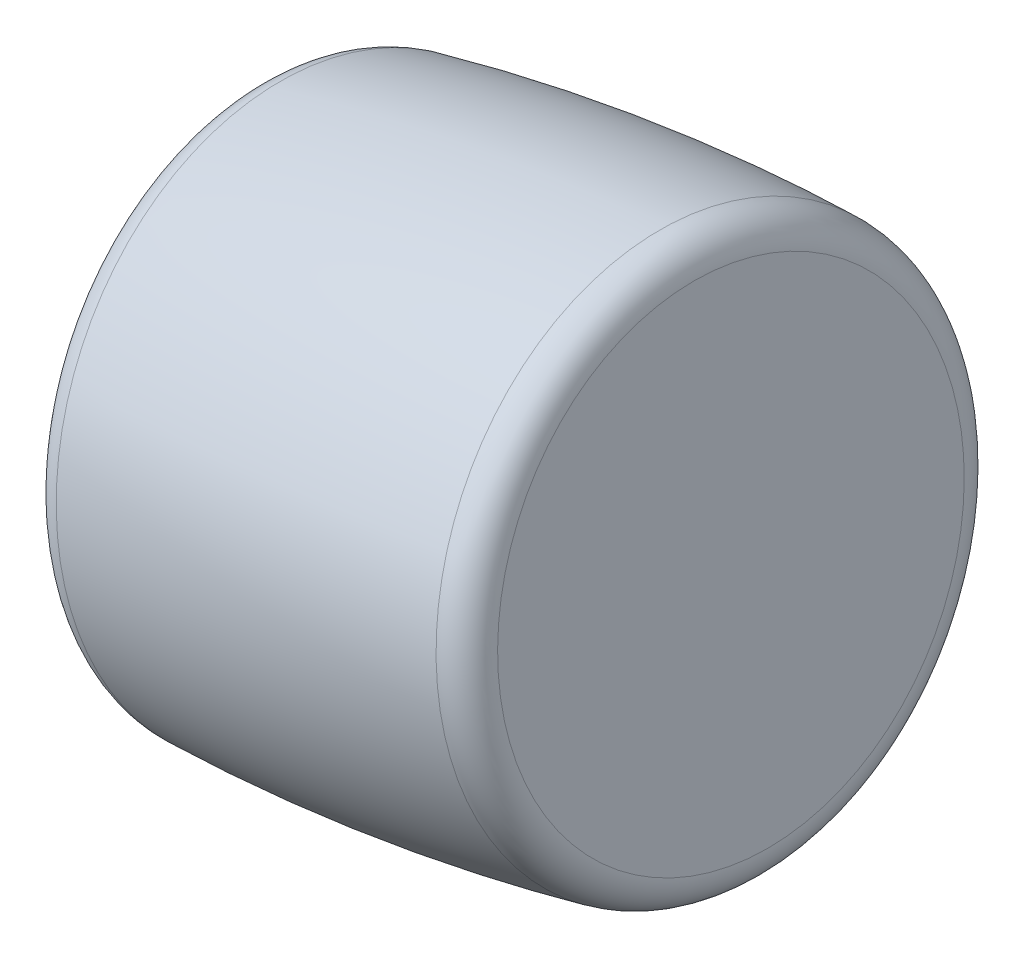
ISO-10303-21;
HEADER;
FILE_DESCRIPTION(('STEP AP214'),'2;1');
FILE_NAME('part.step','',(''),(''),'','','');
FILE_SCHEMA(('AUTOMOTIVE_DESIGN { 1 0 10303 214 1 1 1 1 }'));
ENDSEC;
DATA;
#1=APPLICATION_CONTEXT('core data for automotive mechanical design processes');
#2=APPLICATION_PROTOCOL_DEFINITION('international standard','automotive_design',2000,#1);
#3=PRODUCT_CONTEXT('',#1,'mechanical');
#4=PRODUCT('Part','Part','',(#3));
#5=PRODUCT_RELATED_PRODUCT_CATEGORY('part','',(#4));
#6=PRODUCT_DEFINITION_FORMATION('','',#4);
#7=PRODUCT_DEFINITION_CONTEXT('part definition',#1,'design');
#8=PRODUCT_DEFINITION('design','',#6,#7);
#9=PRODUCT_DEFINITION_SHAPE('','',#8);
#10=(LENGTH_UNIT() NAMED_UNIT(*) SI_UNIT(.MILLI.,.METRE.));
#11=(NAMED_UNIT(*) PLANE_ANGLE_UNIT() SI_UNIT($,.RADIAN.));
#12=(NAMED_UNIT(*) SI_UNIT($,.STERADIAN.) SOLID_ANGLE_UNIT());
#13=UNCERTAINTY_MEASURE_WITH_UNIT(LENGTH_MEASURE(1.E-05),#10,'distance_accuracy_value','');
#14=(GEOMETRIC_REPRESENTATION_CONTEXT(3) GLOBAL_UNCERTAINTY_ASSIGNED_CONTEXT((#13)) GLOBAL_UNIT_ASSIGNED_CONTEXT((#10,
#11,#12)) REPRESENTATION_CONTEXT('',''));
#15=CARTESIAN_POINT('',(0.,0.,0.));
#16=DIRECTION('',(0.,0.,1.));
#17=DIRECTION('',(1.,0.,0.));
#18=AXIS2_PLACEMENT_3D('',#15,#16,#17);
#19=CARTESIAN_POINT('',(1.91577054475343,42.3955666715673,0.));
#20=DIRECTION('',(0.987229020436227,0.159307442414116,0.));
#21=DIRECTION('',(-0.159307442414116,0.987229020436228,0.));
#22=AXIS2_PLACEMENT_3D('',#19,#20,#21);
#23=PLANE('',#22);
#24=CARTESIAN_POINT('',(1.91577054475344,42.3955666715673,0.));
#25=DIRECTION('',(-0.987229020436227,-0.159307442414116,0.));
#26=DIRECTION('',(0.159307442414116,-0.987229020436228,0.));
#27=AXIS2_PLACEMENT_3D('',#24,#25,#26);
#28=CIRCLE('',#27,5.35109540419315);
#29=CARTESIAN_POINT('',(2.76823986770938,37.1128099974249,0.));
#30=VERTEX_POINT('',#29);
#31=EDGE_CURVE('E10',#30,#30,#28,.T.);
#32=ORIENTED_EDGE('',*,*,#31,.T.);
#33=EDGE_LOOP('',(#32));
#34=FACE_BOUND('',#33,.T.);
#35=ADVANCED_FACE('F28',(#34),#23,.F.);
#36=CARTESIAN_POINT('',(2.65619231008048,42.5150472533779,0.));
#37=DIRECTION('',(-0.987229020436227,-0.159307442414116,0.));
#38=DIRECTION('',(0.159307442414116,-0.987229020436228,0.));
#39=AXIS2_PLACEMENT_3D('',#36,#37,#38);
#40=TOROIDAL_SURFACE('',#39,5.35109540419325,0.749999999999872);
#41=ORIENTED_EDGE('',*,*,#31,.F.);
#42=EDGE_LOOP('',(#41));
#43=FACE_BOUND('',#42,.T.);
#44=CARTESIAN_POINT('',(2.58938630205007,42.5042668832136,0.));
#45=DIRECTION('',(-0.987229020436227,-0.159307442414116,0.));
#46=DIRECTION('',(0.159307442414116,-0.987229020436228,0.));
#47=AXIS2_PLACEMENT_3D('',#44,#45,#46);
#48=CIRCLE('',#47,6.09803632616096);
#49=CARTESIAN_POINT('',(3.56084887291915,36.4841084543532,0.));
#50=VERTEX_POINT('',#49);
#51=EDGE_CURVE('E34',#50,#50,#48,.T.);
#52=ORIENTED_EDGE('',*,*,#51,.T.);
#53=EDGE_LOOP('',(#52));
#54=FACE_BOUND('',#53,.T.);
#55=ADVANCED_FACE('F60',(#43,#54),#40,.T.);
#56=CARTESIAN_POINT('',(7.00000000000005,43.216,0.));
#57=DIRECTION('',(-0.987229020436227,-0.159307442414116,0.));
#58=DIRECTION('',(0.159307442414116,-0.987229020436228,0.));
#59=AXIS2_PLACEMENT_3D('',#56,#57,#58);
#60=DEGENERATE_TOROIDAL_SURFACE('',#59,43.2159999999806,49.5159999999806,.F.);
#61=ORIENTED_EDGE('',*,*,#51,.F.);
#62=EDGE_LOOP('',(#61));
#63=FACE_BOUND('',#62,.T.);
#64=CARTESIAN_POINT('',(11.4106135744996,43.9277330968654,0.));
#65=DIRECTION('',(-0.987229020436227,-0.159307442414116,0.));
#66=DIRECTION('',(0.159307442414116,-0.987229020436228,0.));
#67=AXIS2_PLACEMENT_3D('',#64,#65,#66);
#68=CIRCLE('',#67,6.09803633748978);
#69=CARTESIAN_POINT('',(12.3820761471735,37.9075746568209,0.));
#70=VERTEX_POINT('',#69);
#71=EDGE_CURVE('E38',#70,#70,#68,.T.);
#72=ORIENTED_EDGE('',*,*,#71,.T.);
#73=EDGE_LOOP('',(#72));
#74=FACE_BOUND('',#73,.T.);
#75=ADVANCED_FACE('F56',(#63,#74),#60,.F.);
#76=CARTESIAN_POINT('',(11.3438076899195,43.9169527466221,0.));
#77=DIRECTION('',(-0.987229020436227,-0.159307442414116,0.));
#78=DIRECTION('',(0.159307442414116,-0.987229020436228,0.));
#79=AXIS2_PLACEMENT_3D('',#76,#77,#78);
#80=TOROIDAL_SURFACE('',#79,5.35109540419311,0.75);
#81=ORIENTED_EDGE('',*,*,#71,.F.);
#82=EDGE_LOOP('',(#81));
#83=FACE_BOUND('',#82,.T.);
#84=CARTESIAN_POINT('',(12.0842294552466,44.0364333284327,0.));
#85=DIRECTION('',(-0.987229020436227,-0.159307442414116,0.));
#86=DIRECTION('',(0.159307442414116,-0.987229020436228,0.));
#87=AXIS2_PLACEMENT_3D('',#84,#85,#86);
#88=CIRCLE('',#87,5.35109540419314);
#89=CARTESIAN_POINT('',(12.9366987782026,38.7536766542903,0.));
#90=VERTEX_POINT('',#89);
#91=EDGE_CURVE('E42',#90,#90,#88,.T.);
#92=ORIENTED_EDGE('',*,*,#91,.T.);
#93=EDGE_LOOP('',(#92));
#94=FACE_BOUND('',#93,.T.);
#95=ADVANCED_FACE('F48',(#83,#94),#80,.T.);
#96=CARTESIAN_POINT('',(11.2317601322907,49.3191900025751,0.));
#97=DIRECTION('',(-0.987229020436227,-0.159307442414116,0.));
#98=DIRECTION('',(0.159307442414116,-0.987229020436228,0.));
#99=AXIS2_PLACEMENT_3D('',#96,#97,#98);
#100=PLANE('',#99);
#101=ORIENTED_EDGE('',*,*,#91,.F.);
#102=EDGE_LOOP('',(#101));
#103=FACE_BOUND('',#102,.T.);
#104=ADVANCED_FACE('F50',(#103),#100,.F.);
#105=CLOSED_SHELL('',(#35,#55,#75,#95,#104));
#106=MANIFOLD_SOLID_BREP('B2',#105);
#107=ADVANCED_BREP_SHAPE_REPRESENTATION('',(#18,#106),#14);
#108=SHAPE_DEFINITION_REPRESENTATION(#9,#107);
ENDSEC;
END-ISO-10303-21;
